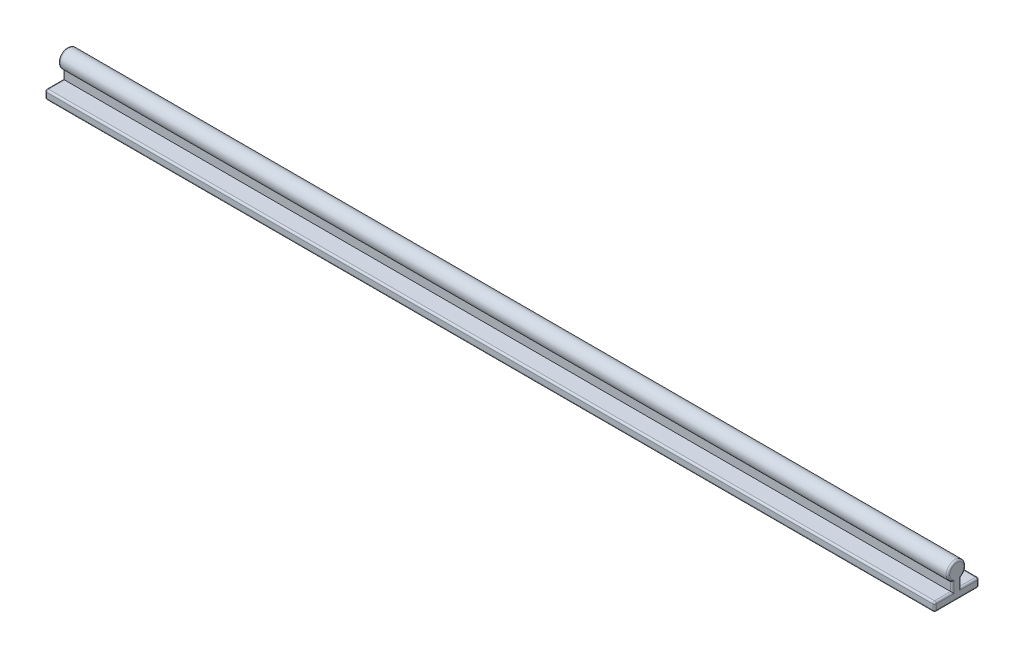
ISO-10303-21;
HEADER;
FILE_DESCRIPTION(('STEP AP214'),'2;1');
FILE_NAME('part.step','',(''),(''),'','','');
FILE_SCHEMA(('AUTOMOTIVE_DESIGN { 1 0 10303 214 1 1 1 1 }'));
ENDSEC;
DATA;
#1=APPLICATION_CONTEXT('core data for automotive mechanical design processes');
#2=APPLICATION_PROTOCOL_DEFINITION('international standard','automotive_design',2000,#1);
#3=PRODUCT_CONTEXT('',#1,'mechanical');
#4=PRODUCT('Part','Part','',(#3));
#5=PRODUCT_RELATED_PRODUCT_CATEGORY('part','',(#4));
#6=PRODUCT_DEFINITION_FORMATION('','',#4);
#7=PRODUCT_DEFINITION_CONTEXT('part definition',#1,'design');
#8=PRODUCT_DEFINITION('design','',#6,#7);
#9=PRODUCT_DEFINITION_SHAPE('','',#8);
#10=(LENGTH_UNIT() NAMED_UNIT(*) SI_UNIT(.MILLI.,.METRE.));
#11=(NAMED_UNIT(*) PLANE_ANGLE_UNIT() SI_UNIT($,.RADIAN.));
#12=(NAMED_UNIT(*) SI_UNIT($,.STERADIAN.) SOLID_ANGLE_UNIT());
#13=UNCERTAINTY_MEASURE_WITH_UNIT(LENGTH_MEASURE(1.E-05),#10,'distance_accuracy_value','');
#14=(GEOMETRIC_REPRESENTATION_CONTEXT(3) GLOBAL_UNCERTAINTY_ASSIGNED_CONTEXT((#13)) GLOBAL_UNIT_ASSIGNED_CONTEXT((#10,
#11,#12)) REPRESENTATION_CONTEXT('',''));
#15=CARTESIAN_POINT('',(0.,0.,0.));
#16=DIRECTION('',(0.,0.,1.));
#17=DIRECTION('',(1.,0.,0.));
#18=AXIS2_PLACEMENT_3D('',#15,#16,#17);
#19=CARTESIAN_POINT('',(500.,10.,-25.));
#20=DIRECTION('',(0.,-1.,0.));
#21=DIRECTION('',(0.,0.,-1.));
#22=AXIS2_PLACEMENT_3D('',#19,#20,#21);
#23=PLANE('',#22);
#24=DIRECTION('',(-1.,0.,0.));
#25=VECTOR('',#24,1.);
#26=CARTESIAN_POINT('',(500.,9.99999999999999,-5.00000000000003));
#27=LINE('',#26,#25);
#28=CARTESIAN_POINT('',(498.,9.99999999999999,-5.00000000000003));
#29=VERTEX_POINT('',#28);
#30=CARTESIAN_POINT('',(-498.,9.99999999999999,-5.00000000000003));
#31=VERTEX_POINT('',#30);
#32=EDGE_CURVE('E201',#29,#31,#27,.T.);
#33=ORIENTED_EDGE('',*,*,#32,.F.);
#34=DIRECTION('',(0.,0.,1.));
#35=VECTOR('',#34,1.);
#36=CARTESIAN_POINT('',(498.,10.,-25.));
#37=LINE('',#36,#35);
#38=CARTESIAN_POINT('',(498.,10.,-23.));
#39=VERTEX_POINT('',#38);
#40=EDGE_CURVE('E238',#29,#39,#37,.F.);
#41=ORIENTED_EDGE('',*,*,#40,.T.);
#42=DIRECTION('',(-1.,0.,0.));
#43=VECTOR('',#42,1.);
#44=CARTESIAN_POINT('',(500.,10.,-23.));
#45=LINE('',#44,#43);
#46=CARTESIAN_POINT('',(-498.,10.,-23.));
#47=VERTEX_POINT('',#46);
#48=EDGE_CURVE('E236',#39,#47,#45,.T.);
#49=ORIENTED_EDGE('',*,*,#48,.T.);
#50=DIRECTION('',(0.,0.,1.));
#51=VECTOR('',#50,1.);
#52=CARTESIAN_POINT('',(-498.,10.,-25.));
#53=LINE('',#52,#51);
#54=EDGE_CURVE('E234',#47,#31,#53,.T.);
#55=ORIENTED_EDGE('',*,*,#54,.T.);
#56=EDGE_LOOP('',(#33,#41,#49,#55));
#57=FACE_BOUND('',#56,.T.);
#58=ADVANCED_FACE('F35',(#57),#23,.F.);
#59=CARTESIAN_POINT('',(500.,9.99999999999999,-5.00000000000003));
#60=DIRECTION('',(0.,0.,1.));
#61=DIRECTION('',(1.,0.,0.));
#62=AXIS2_PLACEMENT_3D('',#59,#60,#61);
#63=PLANE('',#62);
#64=DIRECTION('',(-1.,0.,0.));
#65=VECTOR('',#64,1.);
#66=CARTESIAN_POINT('',(500.,20.,-5.00000000000002));
#67=LINE('',#66,#65);
#68=CARTESIAN_POINT('',(498.,20.,-5.00000000000002));
#69=VERTEX_POINT('',#68);
#70=CARTESIAN_POINT('',(-498.,20.,-5.00000000000002));
#71=VERTEX_POINT('',#70);
#72=EDGE_CURVE('E431',#69,#71,#67,.T.);
#73=ORIENTED_EDGE('',*,*,#72,.F.);
#74=DIRECTION('',(0.,1.,0.));
#75=VECTOR('',#74,1.);
#76=CARTESIAN_POINT('',(498.,9.99999999999999,-5.00000000000003));
#77=LINE('',#76,#75);
#78=EDGE_CURVE('E267',#69,#29,#77,.F.);
#79=ORIENTED_EDGE('',*,*,#78,.T.);
#80=ORIENTED_EDGE('',*,*,#32,.T.);
#81=DIRECTION('',(0.,1.,0.));
#82=VECTOR('',#81,1.);
#83=CARTESIAN_POINT('',(-498.,9.99999999999999,-5.00000000000003));
#84=LINE('',#83,#82);
#85=EDGE_CURVE('E265',#31,#71,#84,.T.);
#86=ORIENTED_EDGE('',*,*,#85,.T.);
#87=EDGE_LOOP('',(#73,#79,#80,#86));
#88=FACE_BOUND('',#87,.T.);
#89=ADVANCED_FACE('F441',(#88),#63,.F.);
#90=CARTESIAN_POINT('',(500.,28.6602540378444,0.));
#91=DIRECTION('',(-1.,0.,0.));
#92=DIRECTION('',(0.,0.,1.));
#93=AXIS2_PLACEMENT_3D('',#90,#91,#92);
#94=CYLINDRICAL_SURFACE('',#93,10.);
#95=DIRECTION('',(-1.,0.,0.));
#96=VECTOR('',#95,1.);
#97=CARTESIAN_POINT('',(500.,20.,4.99999999999999));
#98=LINE('',#97,#96);
#99=CARTESIAN_POINT('',(498.,20.,4.99999999999999));
#100=VERTEX_POINT('',#99);
#101=CARTESIAN_POINT('',(-498.,20.,4.99999999999999));
#102=VERTEX_POINT('',#101);
#103=EDGE_CURVE('E425',#100,#102,#98,.T.);
#104=ORIENTED_EDGE('',*,*,#103,.F.);
#105=CARTESIAN_POINT('',(498.,28.6602540378444,0.));
#106=DIRECTION('',(1.,0.,0.));
#107=DIRECTION('',(0.,0.,-1.));
#108=AXIS2_PLACEMENT_3D('',#105,#106,#107);
#109=CIRCLE('',#108,10.);
#110=EDGE_CURVE('E263',#100,#69,#109,.F.);
#111=ORIENTED_EDGE('',*,*,#110,.T.);
#112=ORIENTED_EDGE('',*,*,#72,.T.);
#113=CARTESIAN_POINT('',(-498.,28.6602540378444,0.));
#114=DIRECTION('',(1.,0.,0.));
#115=DIRECTION('',(0.,0.,-1.));
#116=AXIS2_PLACEMENT_3D('',#113,#114,#115);
#117=CIRCLE('',#116,10.);
#118=EDGE_CURVE('E261',#71,#102,#117,.T.);
#119=ORIENTED_EDGE('',*,*,#118,.T.);
#120=EDGE_LOOP('',(#104,#111,#112,#119));
#121=FACE_BOUND('',#120,.T.);
#122=ADVANCED_FACE('F456',(#121),#94,.T.);
#123=CARTESIAN_POINT('',(500.,9.99999999999999,4.99999999999999));
#124=DIRECTION('',(0.,0.,-1.));
#125=DIRECTION('',(-1.,0.,0.));
#126=AXIS2_PLACEMENT_3D('',#123,#124,#125);
#127=PLANE('',#126);
#128=DIRECTION('',(-1.,0.,0.));
#129=VECTOR('',#128,1.);
#130=CARTESIAN_POINT('',(500.,9.99999999999999,4.99999999999999));
#131=LINE('',#130,#129);
#132=CARTESIAN_POINT('',(498.,9.99999999999999,4.99999999999999));
#133=VERTEX_POINT('',#132);
#134=CARTESIAN_POINT('',(-498.,9.99999999999999,4.99999999999999));
#135=VERTEX_POINT('',#134);
#136=EDGE_CURVE('E419',#133,#135,#131,.T.);
#137=ORIENTED_EDGE('',*,*,#136,.F.);
#138=DIRECTION('',(0.,-1.,0.));
#139=VECTOR('',#138,1.);
#140=CARTESIAN_POINT('',(498.,20.,4.99999999999999));
#141=LINE('',#140,#139);
#142=EDGE_CURVE('E259',#133,#100,#141,.F.);
#143=ORIENTED_EDGE('',*,*,#142,.T.);
#144=ORIENTED_EDGE('',*,*,#103,.T.);
#145=DIRECTION('',(0.,-1.,0.));
#146=VECTOR('',#145,1.);
#147=CARTESIAN_POINT('',(-498.,9.99999999999999,4.99999999999999));
#148=LINE('',#147,#146);
#149=EDGE_CURVE('E257',#102,#135,#148,.T.);
#150=ORIENTED_EDGE('',*,*,#149,.T.);
#151=EDGE_LOOP('',(#137,#143,#144,#150));
#152=FACE_BOUND('',#151,.T.);
#153=ADVANCED_FACE('F459',(#152),#127,.F.);
#154=CARTESIAN_POINT('',(500.,10.,25.));
#155=DIRECTION('',(0.,-1.,0.));
#156=DIRECTION('',(0.,0.,-1.));
#157=AXIS2_PLACEMENT_3D('',#154,#155,#156);
#158=PLANE('',#157);
#159=DIRECTION('',(-1.,0.,0.));
#160=VECTOR('',#159,1.);
#161=CARTESIAN_POINT('',(500.,10.,23.));
#162=LINE('',#161,#160);
#163=CARTESIAN_POINT('',(-498.,10.,23.));
#164=VERTEX_POINT('',#163);
#165=CARTESIAN_POINT('',(498.,10.,23.));
#166=VERTEX_POINT('',#165);
#167=EDGE_CURVE('E178',#164,#166,#162,.F.);
#168=ORIENTED_EDGE('',*,*,#167,.T.);
#169=DIRECTION('',(0.,0.,1.));
#170=VECTOR('',#169,1.);
#171=CARTESIAN_POINT('',(498.,9.99999999999999,4.99999999999999));
#172=LINE('',#171,#170);
#173=EDGE_CURVE('E214',#166,#133,#172,.F.);
#174=ORIENTED_EDGE('',*,*,#173,.T.);
#175=ORIENTED_EDGE('',*,*,#136,.T.);
#176=DIRECTION('',(0.,0.,1.));
#177=VECTOR('',#176,1.);
#178=CARTESIAN_POINT('',(-498.,10.,25.));
#179=LINE('',#178,#177);
#180=EDGE_CURVE('E208',#135,#164,#179,.T.);
#181=ORIENTED_EDGE('',*,*,#180,.T.);
#182=EDGE_LOOP('',(#168,#174,#175,#181));
#183=FACE_BOUND('',#182,.T.);
#184=ADVANCED_FACE('F746',(#183),#158,.F.);
#185=CARTESIAN_POINT('',(500.,0.,25.));
#186=DIRECTION('',(0.,0.,-1.));
#187=DIRECTION('',(-1.,0.,0.));
#188=AXIS2_PLACEMENT_3D('',#185,#186,#187);
#189=PLANE('',#188);
#190=DIRECTION('',(-1.,0.,0.));
#191=VECTOR('',#190,1.);
#192=CARTESIAN_POINT('',(500.,2.,25.));
#193=LINE('',#192,#191);
#194=CARTESIAN_POINT('',(-498.,2.,25.));
#195=VERTEX_POINT('',#194);
#196=CARTESIAN_POINT('',(498.,2.,25.));
#197=VERTEX_POINT('',#196);
#198=EDGE_CURVE('E200',#195,#197,#193,.F.);
#199=ORIENTED_EDGE('',*,*,#198,.T.);
#200=DIRECTION('',(0.,-1.,0.));
#201=VECTOR('',#200,1.);
#202=CARTESIAN_POINT('',(498.,9.99999999999999,25.));
#203=LINE('',#202,#201);
#204=CARTESIAN_POINT('',(498.,8.,25.));
#205=VERTEX_POINT('',#204);
#206=EDGE_CURVE('E205',#197,#205,#203,.F.);
#207=ORIENTED_EDGE('',*,*,#206,.T.);
#208=DIRECTION('',(-1.,0.,0.));
#209=VECTOR('',#208,1.);
#210=CARTESIAN_POINT('',(500.,8.,25.));
#211=LINE('',#210,#209);
#212=CARTESIAN_POINT('',(-498.,8.,25.));
#213=VERTEX_POINT('',#212);
#214=EDGE_CURVE('E176',#205,#213,#211,.T.);
#215=ORIENTED_EDGE('',*,*,#214,.T.);
#216=DIRECTION('',(0.,-1.,0.));
#217=VECTOR('',#216,1.);
#218=CARTESIAN_POINT('',(-498.,0.,25.));
#219=LINE('',#218,#217);
#220=EDGE_CURVE('E194',#213,#195,#219,.T.);
#221=ORIENTED_EDGE('',*,*,#220,.T.);
#222=EDGE_LOOP('',(#199,#207,#215,#221));
#223=FACE_BOUND('',#222,.T.);
#224=ADVANCED_FACE('F203',(#223),#189,.F.);
#225=CARTESIAN_POINT('',(500.,0.,-25.));
#226=DIRECTION('',(0.,1.,0.));
#227=DIRECTION('',(0.,0.,1.));
#228=AXIS2_PLACEMENT_3D('',#225,#226,#227);
#229=PLANE('',#228);
#230=DIRECTION('',(-1.,0.,0.));
#231=VECTOR('',#230,1.);
#232=CARTESIAN_POINT('',(500.,0.,-23.));
#233=LINE('',#232,#231);
#234=CARTESIAN_POINT('',(-498.,0.,-23.));
#235=VERTEX_POINT('',#234);
#236=CARTESIAN_POINT('',(498.,0.,-23.));
#237=VERTEX_POINT('',#236);
#238=EDGE_CURVE('E218',#235,#237,#233,.F.);
#239=ORIENTED_EDGE('',*,*,#238,.T.);
#240=DIRECTION('',(0.,0.,-1.));
#241=VECTOR('',#240,1.);
#242=CARTESIAN_POINT('',(498.,0.,25.));
#243=LINE('',#242,#241);
#244=CARTESIAN_POINT('',(498.,0.,23.));
#245=VERTEX_POINT('',#244);
#246=EDGE_CURVE('E223',#237,#245,#243,.F.);
#247=ORIENTED_EDGE('',*,*,#246,.T.);
#248=DIRECTION('',(-1.,0.,0.));
#249=VECTOR('',#248,1.);
#250=CARTESIAN_POINT('',(500.,0.,23.));
#251=LINE('',#250,#249);
#252=CARTESIAN_POINT('',(-498.,0.,23.));
#253=VERTEX_POINT('',#252);
#254=EDGE_CURVE('E220',#245,#253,#251,.T.);
#255=ORIENTED_EDGE('',*,*,#254,.T.);
#256=DIRECTION('',(0.,0.,-1.));
#257=VECTOR('',#256,1.);
#258=CARTESIAN_POINT('',(-498.,0.,-25.));
#259=LINE('',#258,#257);
#260=EDGE_CURVE('E216',#253,#235,#259,.T.);
#261=ORIENTED_EDGE('',*,*,#260,.T.);
#262=EDGE_LOOP('',(#239,#247,#255,#261));
#263=FACE_BOUND('',#262,.T.);
#264=ADVANCED_FACE('F493',(#263),#229,.F.);
#265=CARTESIAN_POINT('',(500.,0.,-25.));
#266=DIRECTION('',(0.,0.,1.));
#267=DIRECTION('',(1.,0.,0.));
#268=AXIS2_PLACEMENT_3D('',#265,#266,#267);
#269=PLANE('',#268);
#270=DIRECTION('',(-1.,0.,0.));
#271=VECTOR('',#270,1.);
#272=CARTESIAN_POINT('',(500.,8.,-25.));
#273=LINE('',#272,#271);
#274=CARTESIAN_POINT('',(-498.,8.,-25.));
#275=VERTEX_POINT('',#274);
#276=CARTESIAN_POINT('',(498.,8.,-25.));
#277=VERTEX_POINT('',#276);
#278=EDGE_CURVE('E227',#275,#277,#273,.F.);
#279=ORIENTED_EDGE('',*,*,#278,.T.);
#280=DIRECTION('',(0.,1.,0.));
#281=VECTOR('',#280,1.);
#282=CARTESIAN_POINT('',(498.,0.,-25.));
#283=LINE('',#282,#281);
#284=CARTESIAN_POINT('',(498.,2.,-25.));
#285=VERTEX_POINT('',#284);
#286=EDGE_CURVE('E232',#277,#285,#283,.F.);
#287=ORIENTED_EDGE('',*,*,#286,.T.);
#288=DIRECTION('',(-1.,0.,0.));
#289=VECTOR('',#288,1.);
#290=CARTESIAN_POINT('',(500.,2.,-25.));
#291=LINE('',#290,#289);
#292=CARTESIAN_POINT('',(-498.,2.,-25.));
#293=VERTEX_POINT('',#292);
#294=EDGE_CURVE('E229',#285,#293,#291,.T.);
#295=ORIENTED_EDGE('',*,*,#294,.T.);
#296=DIRECTION('',(0.,1.,0.));
#297=VECTOR('',#296,1.);
#298=CARTESIAN_POINT('',(-498.,0.,-25.));
#299=LINE('',#298,#297);
#300=EDGE_CURVE('E225',#293,#275,#299,.T.);
#301=ORIENTED_EDGE('',*,*,#300,.T.);
#302=EDGE_LOOP('',(#279,#287,#295,#301));
#303=FACE_BOUND('',#302,.T.);
#304=ADVANCED_FACE('F723',(#303),#269,.F.);
#305=CARTESIAN_POINT('',(500.,28.6602540378444,0.));
#306=DIRECTION('',(1.,0.,0.));
#307=DIRECTION('',(0.,0.,-1.));
#308=AXIS2_PLACEMENT_3D('',#305,#306,#307);
#309=PLANE('',#308);
#310=DIRECTION('',(0.,0.,-1.));
#311=VECTOR('',#310,1.);
#312=CARTESIAN_POINT('',(500.,2.,-25.));
#313=LINE('',#312,#311);
#314=CARTESIAN_POINT('',(500.,2.,23.));
#315=VERTEX_POINT('',#314);
#316=CARTESIAN_POINT('',(500.,2.,-23.));
#317=VERTEX_POINT('',#316);
#318=EDGE_CURVE('E252',#315,#317,#313,.T.);
#319=ORIENTED_EDGE('',*,*,#318,.T.);
#320=DIRECTION('',(0.,1.,0.));
#321=VECTOR('',#320,1.);
#322=CARTESIAN_POINT('',(500.,9.99999999999999,-23.));
#323=LINE('',#322,#321);
#324=CARTESIAN_POINT('',(500.,8.,-23.));
#325=VERTEX_POINT('',#324);
#326=EDGE_CURVE('E254',#317,#325,#323,.T.);
#327=ORIENTED_EDGE('',*,*,#326,.T.);
#328=DIRECTION('',(0.,0.,1.));
#329=VECTOR('',#328,1.);
#330=CARTESIAN_POINT('',(500.,7.99999999999999,-5.00000000000003));
#331=LINE('',#330,#329);
#332=CARTESIAN_POINT('',(500.,7.99999999999999,-3.00000000000003));
#333=VERTEX_POINT('',#332);
#334=EDGE_CURVE('E240',#325,#333,#331,.T.);
#335=ORIENTED_EDGE('',*,*,#334,.T.);
#336=DIRECTION('',(0.,1.,0.));
#337=VECTOR('',#336,1.);
#338=CARTESIAN_POINT('',(500.,20.,-3.00000000000003));
#339=LINE('',#338,#337);
#340=CARTESIAN_POINT('',(500.,21.2440555507487,-3.00000000000003));
#341=VERTEX_POINT('',#340);
#342=EDGE_CURVE('E242',#333,#341,#339,.T.);
#343=ORIENTED_EDGE('',*,*,#342,.T.);
#344=CARTESIAN_POINT('',(500.,28.6602540378444,0.));
#345=DIRECTION('',(1.,0.,0.));
#346=DIRECTION('',(0.,0.,-1.));
#347=AXIS2_PLACEMENT_3D('',#344,#345,#346);
#348=CIRCLE('',#347,8.00000000000001);
#349=CARTESIAN_POINT('',(500.,21.2440555507487,2.99999999999999));
#350=VERTEX_POINT('',#349);
#351=EDGE_CURVE('E244',#341,#350,#348,.T.);
#352=ORIENTED_EDGE('',*,*,#351,.T.);
#353=DIRECTION('',(0.,-1.,0.));
#354=VECTOR('',#353,1.);
#355=CARTESIAN_POINT('',(500.,9.99999999999999,2.99999999999999));
#356=LINE('',#355,#354);
#357=CARTESIAN_POINT('',(500.,7.99999999999999,2.99999999999999));
#358=VERTEX_POINT('',#357);
#359=EDGE_CURVE('E246',#350,#358,#356,.T.);
#360=ORIENTED_EDGE('',*,*,#359,.T.);
#361=DIRECTION('',(0.,0.,1.));
#362=VECTOR('',#361,1.);
#363=CARTESIAN_POINT('',(500.,8.,25.));
#364=LINE('',#363,#362);
#365=CARTESIAN_POINT('',(500.,8.,23.));
#366=VERTEX_POINT('',#365);
#367=EDGE_CURVE('E248',#358,#366,#364,.T.);
#368=ORIENTED_EDGE('',*,*,#367,.T.);
#369=DIRECTION('',(0.,-1.,0.));
#370=VECTOR('',#369,1.);
#371=CARTESIAN_POINT('',(500.,0.,23.));
#372=LINE('',#371,#370);
#373=EDGE_CURVE('E250',#366,#315,#372,.T.);
#374=ORIENTED_EDGE('',*,*,#373,.T.);
#375=EDGE_LOOP('',(#319,#327,#335,#343,#352,#360,#368,#374));
#376=FACE_BOUND('',#375,.T.);
#377=ADVANCED_FACE('F470',(#376),#309,.T.);
#378=CARTESIAN_POINT('',(-500.,28.6602540378444,0.));
#379=DIRECTION('',(1.,0.,0.));
#380=DIRECTION('',(0.,0.,-1.));
#381=AXIS2_PLACEMENT_3D('',#378,#379,#380);
#382=PLANE('',#381);
#383=CARTESIAN_POINT('',(-500.,28.6602540378444,0.));
#384=DIRECTION('',(1.,0.,0.));
#385=DIRECTION('',(0.,0.,-1.));
#386=AXIS2_PLACEMENT_3D('',#383,#384,#385);
#387=CIRCLE('',#386,8.00000000000001);
#388=CARTESIAN_POINT('',(-500.,21.2440555507487,2.99999999999999));
#389=VERTEX_POINT('',#388);
#390=CARTESIAN_POINT('',(-500.,21.2440555507487,-3.00000000000003));
#391=VERTEX_POINT('',#390);
#392=EDGE_CURVE('E44',#389,#391,#387,.F.);
#393=ORIENTED_EDGE('',*,*,#392,.T.);
#394=DIRECTION('',(0.,1.,0.));
#395=VECTOR('',#394,1.);
#396=CARTESIAN_POINT('',(-500.,28.6602540378444,-3.00000000000003));
#397=LINE('',#396,#395);
#398=CARTESIAN_POINT('',(-500.,7.99999999999999,-3.00000000000003));
#399=VERTEX_POINT('',#398);
#400=EDGE_CURVE('E11',#391,#399,#397,.F.);
#401=ORIENTED_EDGE('',*,*,#400,.T.);
#402=DIRECTION('',(0.,0.,1.));
#403=VECTOR('',#402,1.);
#404=CARTESIAN_POINT('',(-500.,7.99999999999999,0.));
#405=LINE('',#404,#403);
#406=CARTESIAN_POINT('',(-500.,8.,-23.));
#407=VERTEX_POINT('',#406);
#408=EDGE_CURVE('E269',#399,#407,#405,.F.);
#409=ORIENTED_EDGE('',*,*,#408,.T.);
#410=DIRECTION('',(0.,1.,0.));
#411=VECTOR('',#410,1.);
#412=CARTESIAN_POINT('',(-500.,28.6602540378444,-23.));
#413=LINE('',#412,#411);
#414=CARTESIAN_POINT('',(-500.,2.,-23.));
#415=VERTEX_POINT('',#414);
#416=EDGE_CURVE('E271',#407,#415,#413,.F.);
#417=ORIENTED_EDGE('',*,*,#416,.T.);
#418=DIRECTION('',(0.,0.,-1.));
#419=VECTOR('',#418,1.);
#420=CARTESIAN_POINT('',(-500.,2.,0.));
#421=LINE('',#420,#419);
#422=CARTESIAN_POINT('',(-500.,2.,23.));
#423=VERTEX_POINT('',#422);
#424=EDGE_CURVE('E273',#415,#423,#421,.F.);
#425=ORIENTED_EDGE('',*,*,#424,.T.);
#426=DIRECTION('',(0.,-1.,0.));
#427=VECTOR('',#426,1.);
#428=CARTESIAN_POINT('',(-500.,28.6602540378444,23.));
#429=LINE('',#428,#427);
#430=CARTESIAN_POINT('',(-500.,8.,23.));
#431=VERTEX_POINT('',#430);
#432=EDGE_CURVE('E275',#423,#431,#429,.F.);
#433=ORIENTED_EDGE('',*,*,#432,.T.);
#434=DIRECTION('',(0.,0.,1.));
#435=VECTOR('',#434,1.);
#436=CARTESIAN_POINT('',(-500.,7.99999999999999,0.));
#437=LINE('',#436,#435);
#438=CARTESIAN_POINT('',(-500.,7.99999999999999,2.99999999999999));
#439=VERTEX_POINT('',#438);
#440=EDGE_CURVE('E277',#431,#439,#437,.F.);
#441=ORIENTED_EDGE('',*,*,#440,.T.);
#442=DIRECTION('',(0.,-1.,0.));
#443=VECTOR('',#442,1.);
#444=CARTESIAN_POINT('',(-500.,28.6602540378444,2.99999999999999));
#445=LINE('',#444,#443);
#446=EDGE_CURVE('E55',#439,#389,#445,.F.);
#447=ORIENTED_EDGE('',*,*,#446,.T.);
#448=EDGE_LOOP('',(#393,#401,#409,#417,#425,#433,#441,#447));
#449=FACE_BOUND('',#448,.T.);
#450=ADVANCED_FACE('F708',(#449),#382,.F.);
#451=CARTESIAN_POINT('',(500.,8.,-23.));
#452=DIRECTION('',(-1.,0.,0.));
#453=DIRECTION('',(0.,0.,1.));
#454=AXIS2_PLACEMENT_3D('',#451,#452,#453);
#455=CYLINDRICAL_SURFACE('',#454,2.);
#456=CARTESIAN_POINT('',(498.,8.,-23.));
#457=DIRECTION('',(1.,0.,0.));
#458=DIRECTION('',(0.,0.,-1.));
#459=AXIS2_PLACEMENT_3D('',#456,#457,#458);
#460=CIRCLE('',#459,2.);
#461=EDGE_CURVE('E39',#277,#39,#460,.T.);
#462=ORIENTED_EDGE('',*,*,#461,.F.);
#463=ORIENTED_EDGE('',*,*,#278,.F.);
#464=CARTESIAN_POINT('',(-498.,8.,-23.));
#465=DIRECTION('',(-1.,0.,0.));
#466=DIRECTION('',(0.,0.,1.));
#467=AXIS2_PLACEMENT_3D('',#464,#465,#466);
#468=CIRCLE('',#467,2.);
#469=EDGE_CURVE('E412',#47,#275,#468,.T.);
#470=ORIENTED_EDGE('',*,*,#469,.F.);
#471=ORIENTED_EDGE('',*,*,#48,.F.);
#472=EDGE_LOOP('',(#462,#463,#470,#471));
#473=FACE_BOUND('',#472,.T.);
#474=ADVANCED_FACE('F37',(#473),#455,.T.);
#475=CARTESIAN_POINT('',(498.,8.,-23.));
#476=DIRECTION('',(0.,0.,1.));
#477=DIRECTION('',(1.,0.,0.));
#478=AXIS2_PLACEMENT_3D('',#475,#476,#477);
#479=SPHERICAL_SURFACE('',#478,2.);
#480=CARTESIAN_POINT('',(498.,8.,-23.));
#481=DIRECTION('',(0.,1.,0.));
#482=DIRECTION('',(0.,0.,1.));
#483=AXIS2_PLACEMENT_3D('',#480,#481,#482);
#484=CIRCLE('',#483,2.);
#485=EDGE_CURVE('E407',#277,#325,#484,.F.);
#486=ORIENTED_EDGE('',*,*,#485,.F.);
#487=ORIENTED_EDGE('',*,*,#461,.T.);
#488=CARTESIAN_POINT('',(498.,8.,-23.));
#489=DIRECTION('',(0.,0.,-1.));
#490=DIRECTION('',(-1.,0.,0.));
#491=AXIS2_PLACEMENT_3D('',#488,#489,#490);
#492=CIRCLE('',#491,2.);
#493=EDGE_CURVE('E410',#325,#39,#492,.F.);
#494=ORIENTED_EDGE('',*,*,#493,.F.);
#495=EDGE_LOOP('',(#486,#487,#494));
#496=FACE_BOUND('',#495,.T.);
#497=ADVANCED_FACE('F694',(#496),#479,.T.);
#498=CARTESIAN_POINT('',(-498.,8.,-23.));
#499=DIRECTION('',(0.,0.,1.));
#500=DIRECTION('',(1.,0.,0.));
#501=AXIS2_PLACEMENT_3D('',#498,#499,#500);
#502=SPHERICAL_SURFACE('',#501,2.);
#503=CARTESIAN_POINT('',(-498.,8.,-23.));
#504=DIRECTION('',(0.,0.,-1.));
#505=DIRECTION('',(-1.,0.,0.));
#506=AXIS2_PLACEMENT_3D('',#503,#504,#505);
#507=CIRCLE('',#506,2.);
#508=EDGE_CURVE('E401',#47,#407,#507,.F.);
#509=ORIENTED_EDGE('',*,*,#508,.F.);
#510=ORIENTED_EDGE('',*,*,#469,.T.);
#511=CARTESIAN_POINT('',(-498.,8.,-23.));
#512=DIRECTION('',(0.,1.,0.));
#513=DIRECTION('',(0.,0.,1.));
#514=AXIS2_PLACEMENT_3D('',#511,#512,#513);
#515=CIRCLE('',#514,2.);
#516=EDGE_CURVE('E404',#407,#275,#515,.F.);
#517=ORIENTED_EDGE('',*,*,#516,.F.);
#518=EDGE_LOOP('',(#509,#510,#517));
#519=FACE_BOUND('',#518,.T.);
#520=ADVANCED_FACE('F686',(#519),#502,.T.);
#521=CARTESIAN_POINT('',(498.,7.99999999999999,0.));
#522=DIRECTION('',(0.,0.,-1.));
#523=DIRECTION('',(0.,1.,0.));
#524=AXIS2_PLACEMENT_3D('',#521,#522,#523);
#525=CYLINDRICAL_SURFACE('',#524,2.);
#526=ORIENTED_EDGE('',*,*,#493,.T.);
#527=ORIENTED_EDGE('',*,*,#40,.F.);
#528=CARTESIAN_POINT('',(498.,7.99999999999999,-3.00000000000003));
#529=DIRECTION('',(0.,-0.707106781186547,-0.707106781186548));
#530=DIRECTION('',(0.,-0.707106781186548,0.707106781186547));
#531=AXIS2_PLACEMENT_3D('',#528,#529,#530);
#532=ELLIPSE('',#531,2.82842712474619,2.);
#533=EDGE_CURVE('E398',#333,#29,#532,.F.);
#534=ORIENTED_EDGE('',*,*,#533,.F.);
#535=ORIENTED_EDGE('',*,*,#334,.F.);
#536=EDGE_LOOP('',(#526,#527,#534,#535));
#537=FACE_BOUND('',#536,.T.);
#538=ADVANCED_FACE('F507',(#537),#525,.T.);
#539=CARTESIAN_POINT('',(498.,28.6602540378444,-23.));
#540=DIRECTION('',(0.,-1.,0.));
#541=DIRECTION('',(0.,0.,-1.));
#542=AXIS2_PLACEMENT_3D('',#539,#540,#541);
#543=CYLINDRICAL_SURFACE('',#542,2.);
#544=ORIENTED_EDGE('',*,*,#485,.T.);
#545=ORIENTED_EDGE('',*,*,#326,.F.);
#546=CARTESIAN_POINT('',(498.,2.,-23.));
#547=DIRECTION('',(0.,-1.,0.));
#548=DIRECTION('',(1.,0.,0.));
#549=AXIS2_PLACEMENT_3D('',#546,#547,#548);
#550=CIRCLE('',#549,2.);
#551=EDGE_CURVE('E395',#285,#317,#550,.T.);
#552=ORIENTED_EDGE('',*,*,#551,.F.);
#553=ORIENTED_EDGE('',*,*,#286,.F.);
#554=EDGE_LOOP('',(#544,#545,#552,#553));
#555=FACE_BOUND('',#554,.T.);
#556=ADVANCED_FACE('F502',(#555),#543,.T.);
#557=CARTESIAN_POINT('',(500.,2.,-23.));
#558=DIRECTION('',(-1.,0.,0.));
#559=DIRECTION('',(0.,0.,1.));
#560=AXIS2_PLACEMENT_3D('',#557,#558,#559);
#561=CYLINDRICAL_SURFACE('',#560,2.);
#562=CARTESIAN_POINT('',(-498.,2.,-23.));
#563=DIRECTION('',(-1.,0.,0.));
#564=DIRECTION('',(0.,0.,1.));
#565=AXIS2_PLACEMENT_3D('',#562,#563,#564);
#566=CIRCLE('',#565,2.);
#567=EDGE_CURVE('E389',#293,#235,#566,.T.);
#568=ORIENTED_EDGE('',*,*,#567,.F.);
#569=ORIENTED_EDGE('',*,*,#294,.F.);
#570=CARTESIAN_POINT('',(498.,2.,-23.));
#571=DIRECTION('',(1.,0.,0.));
#572=DIRECTION('',(0.,0.,-1.));
#573=AXIS2_PLACEMENT_3D('',#570,#571,#572);
#574=CIRCLE('',#573,2.);
#575=EDGE_CURVE('E392',#237,#285,#574,.T.);
#576=ORIENTED_EDGE('',*,*,#575,.F.);
#577=ORIENTED_EDGE('',*,*,#238,.F.);
#578=EDGE_LOOP('',(#568,#569,#576,#577));
#579=FACE_BOUND('',#578,.T.);
#580=ADVANCED_FACE('F662',(#579),#561,.T.);
#581=CARTESIAN_POINT('',(-498.,0.,-23.));
#582=DIRECTION('',(0.,1.,0.));
#583=DIRECTION('',(0.,0.,1.));
#584=AXIS2_PLACEMENT_3D('',#581,#582,#583);
#585=CYLINDRICAL_SURFACE('',#584,2.);
#586=ORIENTED_EDGE('',*,*,#516,.T.);
#587=ORIENTED_EDGE('',*,*,#300,.F.);
#588=CARTESIAN_POINT('',(-498.,2.,-23.));
#589=DIRECTION('',(0.,-1.,0.));
#590=DIRECTION('',(0.,0.,-1.));
#591=AXIS2_PLACEMENT_3D('',#588,#589,#590);
#592=CIRCLE('',#591,2.);
#593=EDGE_CURVE('E387',#415,#293,#592,.T.);
#594=ORIENTED_EDGE('',*,*,#593,.F.);
#595=ORIENTED_EDGE('',*,*,#416,.F.);
#596=EDGE_LOOP('',(#586,#587,#594,#595));
#597=FACE_BOUND('',#596,.T.);
#598=ADVANCED_FACE('F654',(#597),#585,.T.);
#599=CARTESIAN_POINT('',(-498.,8.,-25.));
#600=DIRECTION('',(0.,0.,1.));
#601=DIRECTION('',(0.,-1.,0.));
#602=AXIS2_PLACEMENT_3D('',#599,#600,#601);
#603=CYLINDRICAL_SURFACE('',#602,2.);
#604=ORIENTED_EDGE('',*,*,#508,.T.);
#605=ORIENTED_EDGE('',*,*,#408,.F.);
#606=CARTESIAN_POINT('',(-498.,7.99999999999999,-3.00000000000003));
#607=DIRECTION('',(0.,0.707106781186547,0.707106781186548));
#608=DIRECTION('',(0.,0.707106781186548,-0.707106781186547));
#609=AXIS2_PLACEMENT_3D('',#606,#607,#608);
#610=ELLIPSE('',#609,2.82842712474619,2.);
#611=EDGE_CURVE('E384',#31,#399,#610,.T.);
#612=ORIENTED_EDGE('',*,*,#611,.F.);
#613=ORIENTED_EDGE('',*,*,#54,.F.);
#614=EDGE_LOOP('',(#604,#605,#612,#613));
#615=FACE_BOUND('',#614,.T.);
#616=ADVANCED_FACE('F374',(#615),#603,.T.);
#617=CARTESIAN_POINT('',(498.,28.6602540378444,-3.00000000000003));
#618=DIRECTION('',(0.,-1.,0.));
#619=DIRECTION('',(0.,0.,-1.));
#620=AXIS2_PLACEMENT_3D('',#617,#618,#619);
#621=CYLINDRICAL_SURFACE('',#620,2.);
#622=ORIENTED_EDGE('',*,*,#533,.T.);
#623=ORIENTED_EDGE('',*,*,#78,.F.);
#624=CARTESIAN_POINT('',(498.,20.,-5.00000000000002));
#625=CARTESIAN_POINT('',(498.050696612318,19.9999959384438,-5.00000857828608));
#626=CARTESIAN_POINT('',(498.10138856125,20.0011128044632,-4.99807260439552));
#627=CARTESIAN_POINT('',(498.202368929843,20.0055570207774,-4.99037714359615));
#628=CARTESIAN_POINT('',(498.252657467024,20.0088837017625,-4.98461881440433));
#629=CARTESIAN_POINT('',(498.352269186816,20.0176986216607,-4.96937458140788));
#630=CARTESIAN_POINT('',(498.401595416699,20.0231781980966,-4.9599036162581));
#631=CARTESIAN_POINT('',(498.499123358672,20.0362354720556,-4.93736538754229));
#632=CARTESIAN_POINT('',(498.547325029307,20.0438132467933,-4.92429799162602));
#633=CARTESIAN_POINT('',(498.689670596168,20.0695751178085,-4.87994658427523));
#634=CARTESIAN_POINT('',(498.781721705348,20.0908027501485,-4.84348726228281));
#635=CARTESIAN_POINT('',(498.957863565528,20.1405730228575,-4.75843488092067));
#636=CARTESIAN_POINT('',(499.041948389366,20.1691210521955,-4.70983288330252));
#637=CARTESIAN_POINT('',(499.204367905921,20.2341204495734,-4.59986243270422));
#638=CARTESIAN_POINT('',(499.282241889711,20.270882005097,-4.53799850237473));
#639=CARTESIAN_POINT('',(499.426421793818,20.3503318144152,-4.405322930176));
#640=CARTESIAN_POINT('',(499.492725128031,20.393021389336,-4.33450929408034));
#641=CARTESIAN_POINT('',(499.620749476141,20.4889588775662,-4.17674899547398));
#642=CARTESIAN_POINT('',(499.680857710136,20.5428595354906,-4.08889246698229));
#643=CARTESIAN_POINT('',(499.785506722603,20.6555670586915,-3.90718309724365));
#644=CARTESIAN_POINT('',(499.830029269294,20.7143795708397,-3.81332338432955));
#645=CARTESIAN_POINT('',(499.911200150959,20.848265349848,-3.60218143806354));
#646=CARTESIAN_POINT('',(499.944306620236,20.9241832563732,-3.48407497879224));
#647=CARTESIAN_POINT('',(499.988449380705,21.0794301340514,-3.24628816038408));
#648=CARTESIAN_POINT('',(499.999526897637,21.1587524492031,-3.1266111639021));
#649=CARTESIAN_POINT('',(499.999995061943,21.2405939710982,-3.00513524395056));
#650=CARTESIAN_POINT('',(500.000000005987,21.2423245818583,-3.00256743417538));
#651=CARTESIAN_POINT('',(500.,21.2440555507487,-3.00000000000003));
#652=B_SPLINE_CURVE_WITH_KNOTS('',3,(#624,#625,#626,#627,#628,#629,#630,#631,#632,#633,#634,
#635,#636,#637,#638,#639,#640,#641,#642,#643,#644,#645,#646,#647,#648,#649,#650,#651),
.UNSPECIFIED.,.F.,.F.,(4,2,2,2,2,2,2,2,2,2,2,2,2,4),(0.,0.152032753048423,0.304019479334239,
0.455400827450645,0.606787747212901,0.909060013550476,1.21155544208783,1.52837226773111,
1.8452598132529,2.20181817883787,2.55879225529751,2.98971636370603,3.41983326412029,
3.42912292529622),.UNSPECIFIED.);
#653=EDGE_CURVE('E378',#341,#69,#652,.F.);
#654=ORIENTED_EDGE('',*,*,#653,.F.);
#655=ORIENTED_EDGE('',*,*,#342,.F.);
#656=EDGE_LOOP('',(#622,#623,#654,#655));
#657=FACE_BOUND('',#656,.T.);
#658=ADVANCED_FACE('F369',(#657),#621,.T.);
#659=CARTESIAN_POINT('',(498.,2.,-23.));
#660=DIRECTION('',(0.,0.,1.));
#661=DIRECTION('',(1.,0.,0.));
#662=AXIS2_PLACEMENT_3D('',#659,#660,#661);
#663=SPHERICAL_SURFACE('',#662,2.);
#664=ORIENTED_EDGE('',*,*,#575,.T.);
#665=ORIENTED_EDGE('',*,*,#551,.T.);
#666=CARTESIAN_POINT('',(498.,2.,-23.));
#667=DIRECTION('',(0.,0.,-1.));
#668=DIRECTION('',(-1.,0.,0.));
#669=AXIS2_PLACEMENT_3D('',#666,#667,#668);
#670=CIRCLE('',#669,2.);
#671=EDGE_CURVE('E385',#237,#317,#670,.F.);
#672=ORIENTED_EDGE('',*,*,#671,.F.);
#673=EDGE_LOOP('',(#664,#665,#672));
#674=FACE_BOUND('',#673,.T.);
#675=ADVANCED_FACE('F373',(#674),#663,.T.);
#676=CARTESIAN_POINT('',(-498.,2.,-23.));
#677=DIRECTION('',(0.,0.,1.));
#678=DIRECTION('',(1.,0.,0.));
#679=AXIS2_PLACEMENT_3D('',#676,#677,#678);
#680=SPHERICAL_SURFACE('',#679,2.);
#681=ORIENTED_EDGE('',*,*,#593,.T.);
#682=ORIENTED_EDGE('',*,*,#567,.T.);
#683=CARTESIAN_POINT('',(-498.,2.,-23.));
#684=DIRECTION('',(0.,0.,-1.));
#685=DIRECTION('',(-1.,0.,0.));
#686=AXIS2_PLACEMENT_3D('',#683,#684,#685);
#687=CIRCLE('',#686,2.);
#688=EDGE_CURVE('E349',#415,#235,#687,.F.);
#689=ORIENTED_EDGE('',*,*,#688,.F.);
#690=EDGE_LOOP('',(#681,#682,#689));
#691=FACE_BOUND('',#690,.T.);
#692=ADVANCED_FACE('F355',(#691),#680,.T.);
#693=CARTESIAN_POINT('',(-498.,9.99999999999999,-3.00000000000003));
#694=DIRECTION('',(0.,1.,0.));
#695=DIRECTION('',(0.,0.,1.));
#696=AXIS2_PLACEMENT_3D('',#693,#694,#695);
#697=CYLINDRICAL_SURFACE('',#696,2.);
#698=ORIENTED_EDGE('',*,*,#611,.T.);
#699=ORIENTED_EDGE('',*,*,#400,.F.);
#700=CARTESIAN_POINT('',(-498.,20.,-5.00000000000002));
#701=CARTESIAN_POINT('',(-498.050696612318,19.9999959384438,-5.00000857828608));
#702=CARTESIAN_POINT('',(-498.10138856125,20.0011128044632,-4.99807260439552));
#703=CARTESIAN_POINT('',(-498.202368929843,20.0055570207774,-4.99037714359615));
#704=CARTESIAN_POINT('',(-498.252657467024,20.0088837017625,-4.98461881440433));
#705=CARTESIAN_POINT('',(-498.352269186816,20.0176986216607,-4.96937458140788));
#706=CARTESIAN_POINT('',(-498.401595416699,20.0231781980966,-4.9599036162581));
#707=CARTESIAN_POINT('',(-498.499123358672,20.0362354720556,-4.93736538754229));
#708=CARTESIAN_POINT('',(-498.547325029307,20.0438132467933,-4.92429799162602));
#709=CARTESIAN_POINT('',(-498.689670596168,20.0695751178085,-4.87994658427523));
#710=CARTESIAN_POINT('',(-498.781721705348,20.0908027501485,-4.84348726228281));
#711=CARTESIAN_POINT('',(-498.957863565528,20.1405730228575,-4.75843488092067));
#712=CARTESIAN_POINT('',(-499.041948389366,20.1691210521955,-4.70983288330252));
#713=CARTESIAN_POINT('',(-499.204367905921,20.2341204495734,-4.59986243270422));
#714=CARTESIAN_POINT('',(-499.282241889711,20.270882005097,-4.53799850237473));
#715=CARTESIAN_POINT('',(-499.426421793818,20.3503318144152,-4.405322930176));
#716=CARTESIAN_POINT('',(-499.492725128031,20.393021389336,-4.33450929408034));
#717=CARTESIAN_POINT('',(-499.620749476141,20.4889588775662,-4.17674899547398));
#718=CARTESIAN_POINT('',(-499.680857710136,20.5428595354906,-4.08889246698229));
#719=CARTESIAN_POINT('',(-499.785506722603,20.6555670586915,-3.90718309724365));
#720=CARTESIAN_POINT('',(-499.830029269294,20.7143795708397,-3.81332338432955));
#721=CARTESIAN_POINT('',(-499.911200150959,20.848265349848,-3.60218143806354));
#722=CARTESIAN_POINT('',(-499.944306620236,20.9241832563732,-3.48407497879224));
#723=CARTESIAN_POINT('',(-499.988449380705,21.0794301340514,-3.24628816038408));
#724=CARTESIAN_POINT('',(-499.999526897637,21.1587524492031,-3.1266111639021));
#725=CARTESIAN_POINT('',(-499.999995061943,21.2405939710982,-3.00513524395056));
#726=CARTESIAN_POINT('',(-500.000000005987,21.2423245818583,-3.00256743417538));
#727=CARTESIAN_POINT('',(-500.,21.2440555507487,-3.00000000000003));
#728=B_SPLINE_CURVE_WITH_KNOTS('',3,(#700,#701,#702,#703,#704,#705,#706,#707,#708,#709,#710,
#711,#712,#713,#714,#715,#716,#717,#718,#719,#720,#721,#722,#723,#724,#725,#726,#727),
.UNSPECIFIED.,.F.,.F.,(4,2,2,2,2,2,2,2,2,2,2,2,2,4),(0.,0.152032753048423,0.304019479334239,
0.455400827450645,0.606787747212901,0.909060013550476,1.21155544208783,1.52837226773111,
1.8452598132529,2.20181817883787,2.55879225529751,2.98971636370603,3.41983326412029,
3.42912292529622),.UNSPECIFIED.);
#729=EDGE_CURVE('E341',#71,#391,#728,.T.);
#730=ORIENTED_EDGE('',*,*,#729,.F.);
#731=ORIENTED_EDGE('',*,*,#85,.F.);
#732=EDGE_LOOP('',(#698,#699,#730,#731));
#733=FACE_BOUND('',#732,.T.);
#734=ADVANCED_FACE('F351',(#733),#697,.T.);
#735=CARTESIAN_POINT('',(498.,28.6602540378444,0.));
#736=DIRECTION('',(1.,0.,0.));
#737=DIRECTION('',(0.,0.,-1.));
#738=AXIS2_PLACEMENT_3D('',#735,#736,#737);
#739=TOROIDAL_SURFACE('',#738,8.00000000000001,2.);
#740=ORIENTED_EDGE('',*,*,#653,.T.);
#741=ORIENTED_EDGE('',*,*,#110,.F.);
#742=CARTESIAN_POINT('',(498.,20.,4.99999999999999));
#743=CARTESIAN_POINT('',(498.050696612318,19.9999959384438,5.00000857828604));
#744=CARTESIAN_POINT('',(498.10138856125,20.0011128044632,4.99807260439549));
#745=CARTESIAN_POINT('',(498.202368929843,20.0055570207774,4.99037714359612));
#746=CARTESIAN_POINT('',(498.252657467024,20.0088837017625,4.9846188144043));
#747=CARTESIAN_POINT('',(498.352269186816,20.0176986216607,4.96937458140785));
#748=CARTESIAN_POINT('',(498.401595416699,20.0231781980966,4.95990361625807));
#749=CARTESIAN_POINT('',(498.499123358672,20.0362354720555,4.93736538754225));
#750=CARTESIAN_POINT('',(498.547325029307,20.0438132467932,4.92429799162598));
#751=CARTESIAN_POINT('',(498.689670596168,20.0695751178085,4.87994658427519));
#752=CARTESIAN_POINT('',(498.781721705348,20.0908027501485,4.84348726228278));
#753=CARTESIAN_POINT('',(498.957863565528,20.1405730228575,4.75843488092063));
#754=CARTESIAN_POINT('',(499.041948389366,20.1691210521955,4.70983288330248));
#755=CARTESIAN_POINT('',(499.204367905921,20.2341204495734,4.59986243270418));
#756=CARTESIAN_POINT('',(499.282241889711,20.270882005097,4.5379985023747));
#757=CARTESIAN_POINT('',(499.426421793818,20.3503318144151,4.40532293017596));
#758=CARTESIAN_POINT('',(499.492725128031,20.393021389336,4.3345092940803));
#759=CARTESIAN_POINT('',(499.620749476141,20.4889588775661,4.17674899547395));
#760=CARTESIAN_POINT('',(499.680857710136,20.5428595354906,4.08889246698227));
#761=CARTESIAN_POINT('',(499.785506722603,20.6555670586915,3.90718309724363));
#762=CARTESIAN_POINT('',(499.830029269294,20.7143795708397,3.81332338432952));
#763=CARTESIAN_POINT('',(499.911200150959,20.848265349848,3.60218143806351));
#764=CARTESIAN_POINT('',(499.944306620236,20.9241832563732,3.4840749787922));
#765=CARTESIAN_POINT('',(499.988449380705,21.0794301340514,3.24628816038405));
#766=CARTESIAN_POINT('',(499.999526897637,21.1587524492031,3.12661116390208));
#767=CARTESIAN_POINT('',(499.999995061943,21.2405939710981,3.00513524395053));
#768=CARTESIAN_POINT('',(500.000000005987,21.2423245818583,3.00256743417535));
#769=CARTESIAN_POINT('',(500.,21.2440555507487,2.99999999999999));
#770=B_SPLINE_CURVE_WITH_KNOTS('',3,(#742,#743,#744,#745,#746,#747,#748,#749,#750,#751,#752,
#753,#754,#755,#756,#757,#758,#759,#760,#761,#762,#763,#764,#765,#766,#767,#768,#769),
.UNSPECIFIED.,.F.,.F.,(4,2,2,2,2,2,2,2,2,2,2,2,2,4),(0.,0.152032753048368,0.304019479334183,
0.455400827450644,0.606787747212902,0.909060013550476,1.21155544208783,1.52837226773111,
1.8452598132529,2.20181817883786,2.55879225529751,2.98971636370603,3.41983326412029,
3.42912292529622),.UNSPECIFIED.);
#771=EDGE_CURVE('E334',#350,#100,#770,.F.);
#772=ORIENTED_EDGE('',*,*,#771,.F.);
#773=ORIENTED_EDGE('',*,*,#351,.F.);
#774=EDGE_LOOP('',(#740,#741,#772,#773));
#775=FACE_BOUND('',#774,.T.);
#776=ADVANCED_FACE('F330',(#775),#739,.T.);
#777=CARTESIAN_POINT('',(498.,2.,0.));
#778=DIRECTION('',(0.,0.,1.));
#779=DIRECTION('',(1.,0.,0.));
#780=AXIS2_PLACEMENT_3D('',#777,#778,#779);
#781=CYLINDRICAL_SURFACE('',#780,2.);
#782=ORIENTED_EDGE('',*,*,#671,.T.);
#783=ORIENTED_EDGE('',*,*,#318,.F.);
#784=CARTESIAN_POINT('',(498.,2.,23.));
#785=DIRECTION('',(0.,0.,1.));
#786=DIRECTION('',(1.,0.,0.));
#787=AXIS2_PLACEMENT_3D('',#784,#785,#786);
#788=CIRCLE('',#787,2.);
#789=EDGE_CURVE('E342',#245,#315,#788,.T.);
#790=ORIENTED_EDGE('',*,*,#789,.F.);
#791=ORIENTED_EDGE('',*,*,#246,.F.);
#792=EDGE_LOOP('',(#782,#783,#790,#791));
#793=FACE_BOUND('',#792,.T.);
#794=ADVANCED_FACE('F364',(#793),#781,.T.);
#795=CARTESIAN_POINT('',(500.,2.,23.));
#796=DIRECTION('',(-1.,0.,0.));
#797=DIRECTION('',(0.,0.,1.));
#798=AXIS2_PLACEMENT_3D('',#795,#796,#797);
#799=CYLINDRICAL_SURFACE('',#798,2.);
#800=CARTESIAN_POINT('',(-498.,2.,23.));
#801=DIRECTION('',(-1.,0.,0.));
#802=DIRECTION('',(0.,0.,1.));
#803=AXIS2_PLACEMENT_3D('',#800,#801,#802);
#804=CIRCLE('',#803,2.);
#805=EDGE_CURVE('E482',#253,#195,#804,.T.);
#806=ORIENTED_EDGE('',*,*,#805,.F.);
#807=ORIENTED_EDGE('',*,*,#254,.F.);
#808=CARTESIAN_POINT('',(498.,2.,23.));
#809=DIRECTION('',(1.,0.,0.));
#810=DIRECTION('',(0.,0.,-1.));
#811=AXIS2_PLACEMENT_3D('',#808,#809,#810);
#812=CIRCLE('',#811,2.);
#813=EDGE_CURVE('E479',#197,#245,#812,.T.);
#814=ORIENTED_EDGE('',*,*,#813,.F.);
#815=ORIENTED_EDGE('',*,*,#198,.F.);
#816=EDGE_LOOP('',(#806,#807,#814,#815));
#817=FACE_BOUND('',#816,.T.);
#818=ADVANCED_FACE('F360',(#817),#799,.T.);
#819=CARTESIAN_POINT('',(-498.,2.,-25.));
#820=DIRECTION('',(0.,0.,-1.));
#821=DIRECTION('',(-1.,0.,0.));
#822=AXIS2_PLACEMENT_3D('',#819,#820,#821);
#823=CYLINDRICAL_SURFACE('',#822,2.);
#824=ORIENTED_EDGE('',*,*,#688,.T.);
#825=ORIENTED_EDGE('',*,*,#260,.F.);
#826=CARTESIAN_POINT('',(-498.,2.,23.));
#827=DIRECTION('',(0.,0.,1.));
#828=DIRECTION('',(1.,0.,0.));
#829=AXIS2_PLACEMENT_3D('',#826,#827,#828);
#830=CIRCLE('',#829,2.);
#831=EDGE_CURVE('E306',#423,#253,#830,.T.);
#832=ORIENTED_EDGE('',*,*,#831,.F.);
#833=ORIENTED_EDGE('',*,*,#424,.F.);
#834=EDGE_LOOP('',(#824,#825,#832,#833));
#835=FACE_BOUND('',#834,.T.);
#836=ADVANCED_FACE('F357',(#835),#823,.T.);
#837=CARTESIAN_POINT('',(-498.,28.6602540378444,0.));
#838=DIRECTION('',(1.,0.,0.));
#839=DIRECTION('',(0.,0.,-1.));
#840=AXIS2_PLACEMENT_3D('',#837,#838,#839);
#841=TOROIDAL_SURFACE('',#840,8.00000000000001,2.);
#842=ORIENTED_EDGE('',*,*,#729,.T.);
#843=ORIENTED_EDGE('',*,*,#392,.F.);
#844=CARTESIAN_POINT('',(-498.,20.,4.99999999999999));
#845=CARTESIAN_POINT('',(-498.050696612318,19.9999959384438,5.00000857828604));
#846=CARTESIAN_POINT('',(-498.10138856125,20.0011128044632,4.99807260439549));
#847=CARTESIAN_POINT('',(-498.202368929843,20.0055570207774,4.99037714359612));
#848=CARTESIAN_POINT('',(-498.252657467024,20.0088837017625,4.9846188144043));
#849=CARTESIAN_POINT('',(-498.352269186816,20.0176986216607,4.96937458140785));
#850=CARTESIAN_POINT('',(-498.401595416699,20.0231781980966,4.95990361625807));
#851=CARTESIAN_POINT('',(-498.499123358672,20.0362354720555,4.93736538754225));
#852=CARTESIAN_POINT('',(-498.547325029307,20.0438132467932,4.92429799162598));
#853=CARTESIAN_POINT('',(-498.689670596168,20.0695751178085,4.87994658427519));
#854=CARTESIAN_POINT('',(-498.781721705348,20.0908027501485,4.84348726228278));
#855=CARTESIAN_POINT('',(-498.957863565528,20.1405730228575,4.75843488092063));
#856=CARTESIAN_POINT('',(-499.041948389366,20.1691210521955,4.70983288330248));
#857=CARTESIAN_POINT('',(-499.204367905921,20.2341204495734,4.59986243270418));
#858=CARTESIAN_POINT('',(-499.282241889711,20.270882005097,4.5379985023747));
#859=CARTESIAN_POINT('',(-499.426421793818,20.3503318144151,4.40532293017596));
#860=CARTESIAN_POINT('',(-499.492725128031,20.393021389336,4.3345092940803));
#861=CARTESIAN_POINT('',(-499.620749476141,20.4889588775661,4.17674899547395));
#862=CARTESIAN_POINT('',(-499.680857710136,20.5428595354906,4.08889246698227));
#863=CARTESIAN_POINT('',(-499.785506722603,20.6555670586915,3.90718309724363));
#864=CARTESIAN_POINT('',(-499.830029269294,20.7143795708397,3.81332338432952));
#865=CARTESIAN_POINT('',(-499.911200150959,20.848265349848,3.60218143806351));
#866=CARTESIAN_POINT('',(-499.944306620236,20.9241832563732,3.4840749787922));
#867=CARTESIAN_POINT('',(-499.988449380705,21.0794301340514,3.24628816038405));
#868=CARTESIAN_POINT('',(-499.999526897637,21.1587524492031,3.12661116390208));
#869=CARTESIAN_POINT('',(-499.999995061943,21.2405939710981,3.00513524395053));
#870=CARTESIAN_POINT('',(-500.000000005987,21.2423245818583,3.00256743417535));
#871=CARTESIAN_POINT('',(-500.,21.2440555507487,2.99999999999999));
#872=B_SPLINE_CURVE_WITH_KNOTS('',3,(#844,#845,#846,#847,#848,#849,#850,#851,#852,#853,#854,
#855,#856,#857,#858,#859,#860,#861,#862,#863,#864,#865,#866,#867,#868,#869,#870,#871),
.UNSPECIFIED.,.F.,.F.,(4,2,2,2,2,2,2,2,2,2,2,2,2,4),(0.,0.152032753048368,0.304019479334183,
0.455400827450644,0.606787747212902,0.909060013550476,1.21155544208783,1.52837226773111,
1.8452598132529,2.20181817883786,2.55879225529751,2.98971636370603,3.41983326412029,
3.42912292529622),.UNSPECIFIED.);
#873=EDGE_CURVE('E298',#102,#389,#872,.T.);
#874=ORIENTED_EDGE('',*,*,#873,.F.);
#875=ORIENTED_EDGE('',*,*,#118,.F.);
#876=EDGE_LOOP('',(#842,#843,#874,#875));
#877=FACE_BOUND('',#876,.T.);
#878=ADVANCED_FACE('F308',(#877),#841,.T.);
#879=CARTESIAN_POINT('',(498.,28.6602540378444,2.99999999999999));
#880=DIRECTION('',(0.,1.,0.));
#881=DIRECTION('',(0.,0.,1.));
#882=AXIS2_PLACEMENT_3D('',#879,#880,#881);
#883=CYLINDRICAL_SURFACE('',#882,2.);
#884=ORIENTED_EDGE('',*,*,#771,.T.);
#885=ORIENTED_EDGE('',*,*,#142,.F.);
#886=CARTESIAN_POINT('',(498.,7.99999999999999,2.99999999999999));
#887=DIRECTION('',(0.,0.707106781186547,-0.707106781186548));
#888=DIRECTION('',(0.,-0.707106781186548,-0.707106781186547));
#889=AXIS2_PLACEMENT_3D('',#886,#887,#888);
#890=ELLIPSE('',#889,2.82842712474619,2.);
#891=EDGE_CURVE('E295',#358,#133,#890,.F.);
#892=ORIENTED_EDGE('',*,*,#891,.F.);
#893=ORIENTED_EDGE('',*,*,#359,.F.);
#894=EDGE_LOOP('',(#884,#885,#892,#893));
#895=FACE_BOUND('',#894,.T.);
#896=ADVANCED_FACE('F324',(#895),#883,.T.);
#897=CARTESIAN_POINT('',(498.,2.,23.));
#898=DIRECTION('',(0.,0.,1.));
#899=DIRECTION('',(1.,0.,0.));
#900=AXIS2_PLACEMENT_3D('',#897,#898,#899);
#901=SPHERICAL_SURFACE('',#900,2.);
#902=ORIENTED_EDGE('',*,*,#813,.T.);
#903=ORIENTED_EDGE('',*,*,#789,.T.);
#904=CARTESIAN_POINT('',(498.,2.,23.));
#905=DIRECTION('',(0.,-1.,0.));
#906=DIRECTION('',(0.,0.,-1.));
#907=AXIS2_PLACEMENT_3D('',#904,#905,#906);
#908=CIRCLE('',#907,2.);
#909=EDGE_CURVE('E292',#197,#315,#908,.F.);
#910=ORIENTED_EDGE('',*,*,#909,.F.);
#911=EDGE_LOOP('',(#902,#903,#910));
#912=FACE_BOUND('',#911,.T.);
#913=ADVANCED_FACE('F320',(#912),#901,.T.);
#914=CARTESIAN_POINT('',(-498.,2.,23.));
#915=DIRECTION('',(0.,0.,1.));
#916=DIRECTION('',(1.,0.,0.));
#917=AXIS2_PLACEMENT_3D('',#914,#915,#916);
#918=SPHERICAL_SURFACE('',#917,2.);
#919=ORIENTED_EDGE('',*,*,#831,.T.);
#920=ORIENTED_EDGE('',*,*,#805,.T.);
#921=CARTESIAN_POINT('',(-498.,2.,23.));
#922=DIRECTION('',(0.,-1.,0.));
#923=DIRECTION('',(0.,0.,-1.));
#924=AXIS2_PLACEMENT_3D('',#921,#922,#923);
#925=CIRCLE('',#924,2.);
#926=EDGE_CURVE('E197',#423,#195,#925,.F.);
#927=ORIENTED_EDGE('',*,*,#926,.F.);
#928=EDGE_LOOP('',(#919,#920,#927));
#929=FACE_BOUND('',#928,.T.);
#930=ADVANCED_FACE('F316',(#929),#918,.T.);
#931=CARTESIAN_POINT('',(-498.,9.99999999999999,2.99999999999999));
#932=DIRECTION('',(0.,-1.,0.));
#933=DIRECTION('',(0.,0.,-1.));
#934=AXIS2_PLACEMENT_3D('',#931,#932,#933);
#935=CYLINDRICAL_SURFACE('',#934,2.);
#936=ORIENTED_EDGE('',*,*,#873,.T.);
#937=ORIENTED_EDGE('',*,*,#446,.F.);
#938=CARTESIAN_POINT('',(-498.,7.99999999999999,2.99999999999999));
#939=DIRECTION('',(0.,-0.707106781186547,0.707106781186548));
#940=DIRECTION('',(0.,-0.707106781186548,-0.707106781186547));
#941=AXIS2_PLACEMENT_3D('',#938,#939,#940);
#942=ELLIPSE('',#941,2.82842712474619,2.);
#943=EDGE_CURVE('E288',#135,#439,#942,.T.);
#944=ORIENTED_EDGE('',*,*,#943,.F.);
#945=ORIENTED_EDGE('',*,*,#149,.F.);
#946=EDGE_LOOP('',(#936,#937,#944,#945));
#947=FACE_BOUND('',#946,.T.);
#948=ADVANCED_FACE('F311',(#947),#935,.T.);
#949=CARTESIAN_POINT('',(498.,7.99999999999999,0.));
#950=DIRECTION('',(0.,0.,-1.));
#951=DIRECTION('',(0.,1.,0.));
#952=AXIS2_PLACEMENT_3D('',#949,#950,#951);
#953=CYLINDRICAL_SURFACE('',#952,2.);
#954=ORIENTED_EDGE('',*,*,#891,.T.);
#955=ORIENTED_EDGE('',*,*,#173,.F.);
#956=CARTESIAN_POINT('',(498.,8.,23.));
#957=DIRECTION('',(0.,0.,1.));
#958=DIRECTION('',(1.,0.,0.));
#959=AXIS2_PLACEMENT_3D('',#956,#957,#958);
#960=CIRCLE('',#959,2.);
#961=EDGE_CURVE('E285',#366,#166,#960,.T.);
#962=ORIENTED_EDGE('',*,*,#961,.F.);
#963=ORIENTED_EDGE('',*,*,#367,.F.);
#964=EDGE_LOOP('',(#954,#955,#962,#963));
#965=FACE_BOUND('',#964,.T.);
#966=ADVANCED_FACE('F315',(#965),#953,.T.);
#967=CARTESIAN_POINT('',(498.,28.6602540378444,23.));
#968=DIRECTION('',(0.,1.,0.));
#969=DIRECTION('',(0.,0.,1.));
#970=AXIS2_PLACEMENT_3D('',#967,#968,#969);
#971=CYLINDRICAL_SURFACE('',#970,2.);
#972=ORIENTED_EDGE('',*,*,#909,.T.);
#973=ORIENTED_EDGE('',*,*,#373,.F.);
#974=CARTESIAN_POINT('',(498.,8.,23.));
#975=DIRECTION('',(0.,1.,0.));
#976=DIRECTION('',(0.,0.,1.));
#977=AXIS2_PLACEMENT_3D('',#974,#975,#976);
#978=CIRCLE('',#977,2.);
#979=EDGE_CURVE('E191',#205,#366,#978,.T.);
#980=ORIENTED_EDGE('',*,*,#979,.F.);
#981=ORIENTED_EDGE('',*,*,#206,.F.);
#982=EDGE_LOOP('',(#972,#973,#980,#981));
#983=FACE_BOUND('',#982,.T.);
#984=ADVANCED_FACE('F473',(#983),#971,.T.);
#985=CARTESIAN_POINT('',(-498.,0.,23.));
#986=DIRECTION('',(0.,-1.,0.));
#987=DIRECTION('',(0.,0.,-1.));
#988=AXIS2_PLACEMENT_3D('',#985,#986,#987);
#989=CYLINDRICAL_SURFACE('',#988,2.);
#990=ORIENTED_EDGE('',*,*,#926,.T.);
#991=ORIENTED_EDGE('',*,*,#220,.F.);
#992=CARTESIAN_POINT('',(-498.,8.,23.));
#993=DIRECTION('',(0.,1.,0.));
#994=DIRECTION('',(0.,0.,1.));
#995=AXIS2_PLACEMENT_3D('',#992,#993,#994);
#996=CIRCLE('',#995,2.);
#997=EDGE_CURVE('E184',#431,#213,#996,.T.);
#998=ORIENTED_EDGE('',*,*,#997,.F.);
#999=ORIENTED_EDGE('',*,*,#432,.F.);
#1000=EDGE_LOOP('',(#990,#991,#998,#999));
#1001=FACE_BOUND('',#1000,.T.);
#1002=ADVANCED_FACE('F195',(#1001),#989,.T.);
#1003=CARTESIAN_POINT('',(-498.,8.,25.));
#1004=DIRECTION('',(0.,0.,1.));
#1005=DIRECTION('',(0.,-1.,0.));
#1006=AXIS2_PLACEMENT_3D('',#1003,#1004,#1005);
#1007=CYLINDRICAL_SURFACE('',#1006,2.);
#1008=ORIENTED_EDGE('',*,*,#943,.T.);
#1009=ORIENTED_EDGE('',*,*,#440,.F.);
#1010=CARTESIAN_POINT('',(-498.,8.,23.));
#1011=DIRECTION('',(0.,0.,1.));
#1012=DIRECTION('',(1.,0.,0.));
#1013=AXIS2_PLACEMENT_3D('',#1010,#1011,#1012);
#1014=CIRCLE('',#1013,2.);
#1015=EDGE_CURVE('E188',#164,#431,#1014,.T.);
#1016=ORIENTED_EDGE('',*,*,#1015,.F.);
#1017=ORIENTED_EDGE('',*,*,#180,.F.);
#1018=EDGE_LOOP('',(#1008,#1009,#1016,#1017));
#1019=FACE_BOUND('',#1018,.T.);
#1020=ADVANCED_FACE('F528',(#1019),#1007,.T.);
#1021=CARTESIAN_POINT('',(498.,8.,23.));
#1022=DIRECTION('',(0.,0.,1.));
#1023=DIRECTION('',(1.,0.,0.));
#1024=AXIS2_PLACEMENT_3D('',#1021,#1022,#1023);
#1025=SPHERICAL_SURFACE('',#1024,2.);
#1026=ORIENTED_EDGE('',*,*,#979,.T.);
#1027=ORIENTED_EDGE('',*,*,#961,.T.);
#1028=CARTESIAN_POINT('',(498.,8.,23.));
#1029=DIRECTION('',(1.,0.,0.));
#1030=DIRECTION('',(0.,0.,-1.));
#1031=AXIS2_PLACEMENT_3D('',#1028,#1029,#1030);
#1032=CIRCLE('',#1031,2.);
#1033=EDGE_CURVE('E181',#205,#166,#1032,.F.);
#1034=ORIENTED_EDGE('',*,*,#1033,.F.);
#1035=EDGE_LOOP('',(#1026,#1027,#1034));
#1036=FACE_BOUND('',#1035,.T.);
#1037=ADVANCED_FACE('F525',(#1036),#1025,.T.);
#1038=CARTESIAN_POINT('',(-498.,8.,23.));
#1039=DIRECTION('',(0.,0.,1.));
#1040=DIRECTION('',(1.,0.,0.));
#1041=AXIS2_PLACEMENT_3D('',#1038,#1039,#1040);
#1042=SPHERICAL_SURFACE('',#1041,2.);
#1043=ORIENTED_EDGE('',*,*,#1015,.T.);
#1044=ORIENTED_EDGE('',*,*,#997,.T.);
#1045=CARTESIAN_POINT('',(-498.,8.,23.));
#1046=DIRECTION('',(-1.,0.,0.));
#1047=DIRECTION('',(0.,0.,1.));
#1048=AXIS2_PLACEMENT_3D('',#1045,#1046,#1047);
#1049=CIRCLE('',#1048,2.);
#1050=EDGE_CURVE('E172',#164,#213,#1049,.F.);
#1051=ORIENTED_EDGE('',*,*,#1050,.F.);
#1052=EDGE_LOOP('',(#1043,#1044,#1051));
#1053=FACE_BOUND('',#1052,.T.);
#1054=ADVANCED_FACE('F186',(#1053),#1042,.T.);
#1055=CARTESIAN_POINT('',(500.,8.,23.));
#1056=DIRECTION('',(-1.,0.,0.));
#1057=DIRECTION('',(0.,0.,1.));
#1058=AXIS2_PLACEMENT_3D('',#1055,#1056,#1057);
#1059=CYLINDRICAL_SURFACE('',#1058,2.);
#1060=ORIENTED_EDGE('',*,*,#1033,.T.);
#1061=ORIENTED_EDGE('',*,*,#167,.F.);
#1062=ORIENTED_EDGE('',*,*,#1050,.T.);
#1063=ORIENTED_EDGE('',*,*,#214,.F.);
#1064=EDGE_LOOP('',(#1060,#1061,#1062,#1063));
#1065=FACE_BOUND('',#1064,.T.);
#1066=ADVANCED_FACE('F174',(#1065),#1059,.T.);
#1067=CLOSED_SHELL('',(#58,#89,#122,#153,#184,#224,#264,#304,#377,#450,#474,#497,#520,#538,#556,
#580,#598,#616,#658,#675,#692,#734,#776,#794,#818,#836,#878,#896,#913,#930,#948,#966,#984,#1002,
#1020,#1037,#1054,#1066));
#1068=MANIFOLD_SOLID_BREP('B2',#1067);
#1069=ADVANCED_BREP_SHAPE_REPRESENTATION('',(#18,#1068),#14);
#1070=SHAPE_DEFINITION_REPRESENTATION(#9,#1069);
ENDSEC;
END-ISO-10303-21;
